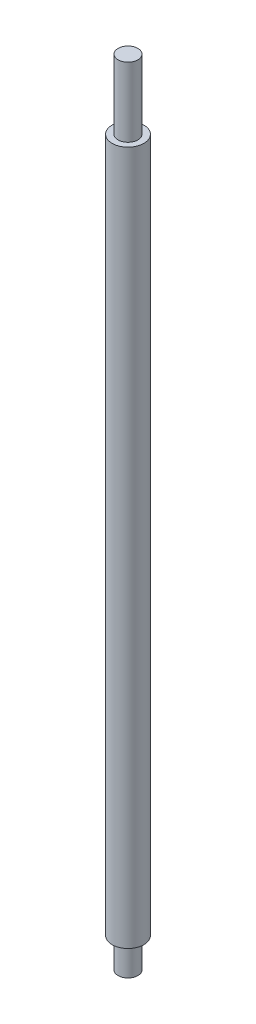
ISO-10303-21;
HEADER;
FILE_DESCRIPTION(('STEP AP214'),'2;1');
FILE_NAME('part.step','',(''),(''),'','','');
FILE_SCHEMA(('AUTOMOTIVE_DESIGN { 1 0 10303 214 1 1 1 1 }'));
ENDSEC;
DATA;
#1=APPLICATION_CONTEXT('core data for automotive mechanical design processes');
#2=APPLICATION_PROTOCOL_DEFINITION('international standard','automotive_design',2000,#1);
#3=PRODUCT_CONTEXT('',#1,'mechanical');
#4=PRODUCT('Part','Part','',(#3));
#5=PRODUCT_RELATED_PRODUCT_CATEGORY('part','',(#4));
#6=PRODUCT_DEFINITION_FORMATION('','',#4);
#7=PRODUCT_DEFINITION_CONTEXT('part definition',#1,'design');
#8=PRODUCT_DEFINITION('design','',#6,#7);
#9=PRODUCT_DEFINITION_SHAPE('','',#8);
#10=(LENGTH_UNIT() NAMED_UNIT(*) SI_UNIT(.MILLI.,.METRE.));
#11=(NAMED_UNIT(*) PLANE_ANGLE_UNIT() SI_UNIT($,.RADIAN.));
#12=(NAMED_UNIT(*) SI_UNIT($,.STERADIAN.) SOLID_ANGLE_UNIT());
#13=UNCERTAINTY_MEASURE_WITH_UNIT(LENGTH_MEASURE(1.E-05),#10,'distance_accuracy_value','');
#14=(GEOMETRIC_REPRESENTATION_CONTEXT(3) GLOBAL_UNCERTAINTY_ASSIGNED_CONTEXT((#13)) GLOBAL_UNIT_ASSIGNED_CONTEXT((#10,
#11,#12)) REPRESENTATION_CONTEXT('',''));
#15=CARTESIAN_POINT('',(0.,0.,0.));
#16=DIRECTION('',(0.,0.,1.));
#17=DIRECTION('',(1.,0.,0.));
#18=AXIS2_PLACEMENT_3D('',#15,#16,#17);
#19=CARTESIAN_POINT('',(0.,350.,0.));
#20=DIRECTION('',(0.,-1.,0.));
#21=DIRECTION('',(0.,0.,-1.));
#22=AXIS2_PLACEMENT_3D('',#19,#20,#21);
#23=CYLINDRICAL_SURFACE('',#22,8.);
#24=CARTESIAN_POINT('',(0.,350.,0.));
#25=DIRECTION('',(0.,1.,0.));
#26=DIRECTION('',(0.,0.,1.));
#27=AXIS2_PLACEMENT_3D('',#24,#25,#26);
#28=CIRCLE('',#27,8.);
#29=CARTESIAN_POINT('',(0.,350.,8.));
#30=VERTEX_POINT('',#29);
#31=EDGE_CURVE('E37',#30,#30,#28,.T.);
#32=ORIENTED_EDGE('',*,*,#31,.F.);
#33=EDGE_LOOP('',(#32));
#34=FACE_BOUND('',#33,.T.);
#35=CARTESIAN_POINT('',(0.,0.,0.));
#36=DIRECTION('',(0.,1.,0.));
#37=DIRECTION('',(0.,0.,1.));
#38=AXIS2_PLACEMENT_3D('',#35,#36,#37);
#39=CIRCLE('',#38,8.);
#40=CARTESIAN_POINT('',(0.,0.,8.));
#41=VERTEX_POINT('',#40);
#42=EDGE_CURVE('E41',#41,#41,#39,.T.);
#43=ORIENTED_EDGE('',*,*,#42,.T.);
#44=EDGE_LOOP('',(#43));
#45=FACE_BOUND('',#44,.T.);
#46=ADVANCED_FACE('F31',(#34,#45),#23,.T.);
#47=CARTESIAN_POINT('',(0.,350.,0.));
#48=DIRECTION('',(0.,1.,0.));
#49=DIRECTION('',(0.,0.,1.));
#50=AXIS2_PLACEMENT_3D('',#47,#48,#49);
#51=PLANE('',#50);
#52=CARTESIAN_POINT('',(0.,350.,0.));
#53=DIRECTION('',(0.,1.,0.));
#54=DIRECTION('',(0.,0.,1.));
#55=AXIS2_PLACEMENT_3D('',#52,#53,#54);
#56=CIRCLE('',#55,5.);
#57=CARTESIAN_POINT('',(0.,350.,5.));
#58=VERTEX_POINT('',#57);
#59=EDGE_CURVE('E48',#58,#58,#56,.T.);
#60=ORIENTED_EDGE('',*,*,#59,.F.);
#61=EDGE_LOOP('',(#60));
#62=FACE_BOUND('',#61,.T.);
#63=ORIENTED_EDGE('',*,*,#31,.T.);
#64=EDGE_LOOP('',(#63));
#65=FACE_BOUND('',#64,.T.);
#66=ADVANCED_FACE('F72',(#62,#65),#51,.T.);
#67=CARTESIAN_POINT('',(0.,0.,0.));
#68=DIRECTION('',(0.,1.,0.));
#69=DIRECTION('',(0.,0.,1.));
#70=AXIS2_PLACEMENT_3D('',#67,#68,#69);
#71=PLANE('',#70);
#72=CARTESIAN_POINT('',(0.,0.,0.));
#73=DIRECTION('',(0.,1.,0.));
#74=DIRECTION('',(0.,0.,1.));
#75=AXIS2_PLACEMENT_3D('',#72,#73,#74);
#76=CIRCLE('',#75,5.);
#77=CARTESIAN_POINT('',(0.,0.,5.));
#78=VERTEX_POINT('',#77);
#79=EDGE_CURVE('E10',#78,#78,#76,.F.);
#80=ORIENTED_EDGE('',*,*,#79,.F.);
#81=EDGE_LOOP('',(#80));
#82=FACE_BOUND('',#81,.T.);
#83=ORIENTED_EDGE('',*,*,#42,.F.);
#84=EDGE_LOOP('',(#83));
#85=FACE_BOUND('',#84,.T.);
#86=ADVANCED_FACE('F77',(#82,#85),#71,.F.);
#87=CARTESIAN_POINT('',(0.,385.,0.));
#88=DIRECTION('',(0.,-1.,0.));
#89=DIRECTION('',(0.,0.,-1.));
#90=AXIS2_PLACEMENT_3D('',#87,#88,#89);
#91=CYLINDRICAL_SURFACE('',#90,5.);
#92=CARTESIAN_POINT('',(0.,385.,0.));
#93=DIRECTION('',(0.,1.,0.));
#94=DIRECTION('',(0.,0.,1.));
#95=AXIS2_PLACEMENT_3D('',#92,#93,#94);
#96=CIRCLE('',#95,5.);
#97=CARTESIAN_POINT('',(0.,385.,5.));
#98=VERTEX_POINT('',#97);
#99=EDGE_CURVE('E46',#98,#98,#96,.T.);
#100=ORIENTED_EDGE('',*,*,#99,.F.);
#101=EDGE_LOOP('',(#100));
#102=FACE_BOUND('',#101,.T.);
#103=ORIENTED_EDGE('',*,*,#59,.T.);
#104=EDGE_LOOP('',(#103));
#105=FACE_BOUND('',#104,.T.);
#106=ADVANCED_FACE('F68',(#102,#105),#91,.T.);
#107=CARTESIAN_POINT('',(0.,385.,0.));
#108=DIRECTION('',(0.,1.,0.));
#109=DIRECTION('',(0.,0.,1.));
#110=AXIS2_PLACEMENT_3D('',#107,#108,#109);
#111=PLANE('',#110);
#112=ORIENTED_EDGE('',*,*,#99,.T.);
#113=EDGE_LOOP('',(#112));
#114=FACE_BOUND('',#113,.T.);
#115=ADVANCED_FACE('F61',(#114),#111,.T.);
#116=CARTESIAN_POINT('',(0.,-15.,0.));
#117=DIRECTION('',(0.,1.,0.));
#118=DIRECTION('',(0.,0.,1.));
#119=AXIS2_PLACEMENT_3D('',#116,#117,#118);
#120=CYLINDRICAL_SURFACE('',#119,5.);
#121=CARTESIAN_POINT('',(0.,-15.,0.));
#122=DIRECTION('',(0.,-1.,0.));
#123=DIRECTION('',(0.,0.,-1.));
#124=AXIS2_PLACEMENT_3D('',#121,#122,#123);
#125=CIRCLE('',#124,5.);
#126=CARTESIAN_POINT('',(0.,-15.,-5.));
#127=VERTEX_POINT('',#126);
#128=EDGE_CURVE('E51',#127,#127,#125,.T.);
#129=ORIENTED_EDGE('',*,*,#128,.F.);
#130=EDGE_LOOP('',(#129));
#131=FACE_BOUND('',#130,.T.);
#132=ORIENTED_EDGE('',*,*,#79,.T.);
#133=EDGE_LOOP('',(#132));
#134=FACE_BOUND('',#133,.T.);
#135=ADVANCED_FACE('F59',(#131,#134),#120,.T.);
#136=CARTESIAN_POINT('',(0.,-15.,0.));
#137=DIRECTION('',(0.,-1.,0.));
#138=DIRECTION('',(0.,0.,-1.));
#139=AXIS2_PLACEMENT_3D('',#136,#137,#138);
#140=PLANE('',#139);
#141=ORIENTED_EDGE('',*,*,#128,.T.);
#142=EDGE_LOOP('',(#141));
#143=FACE_BOUND('',#142,.T.);
#144=ADVANCED_FACE('F57',(#143),#140,.T.);
#145=CLOSED_SHELL('',(#46,#66,#86,#106,#115,#135,#144));
#146=MANIFOLD_SOLID_BREP('B2',#145);
#147=ADVANCED_BREP_SHAPE_REPRESENTATION('',(#18,#146),#14);
#148=SHAPE_DEFINITION_REPRESENTATION(#9,#147);
ENDSEC;
END-ISO-10303-21;
